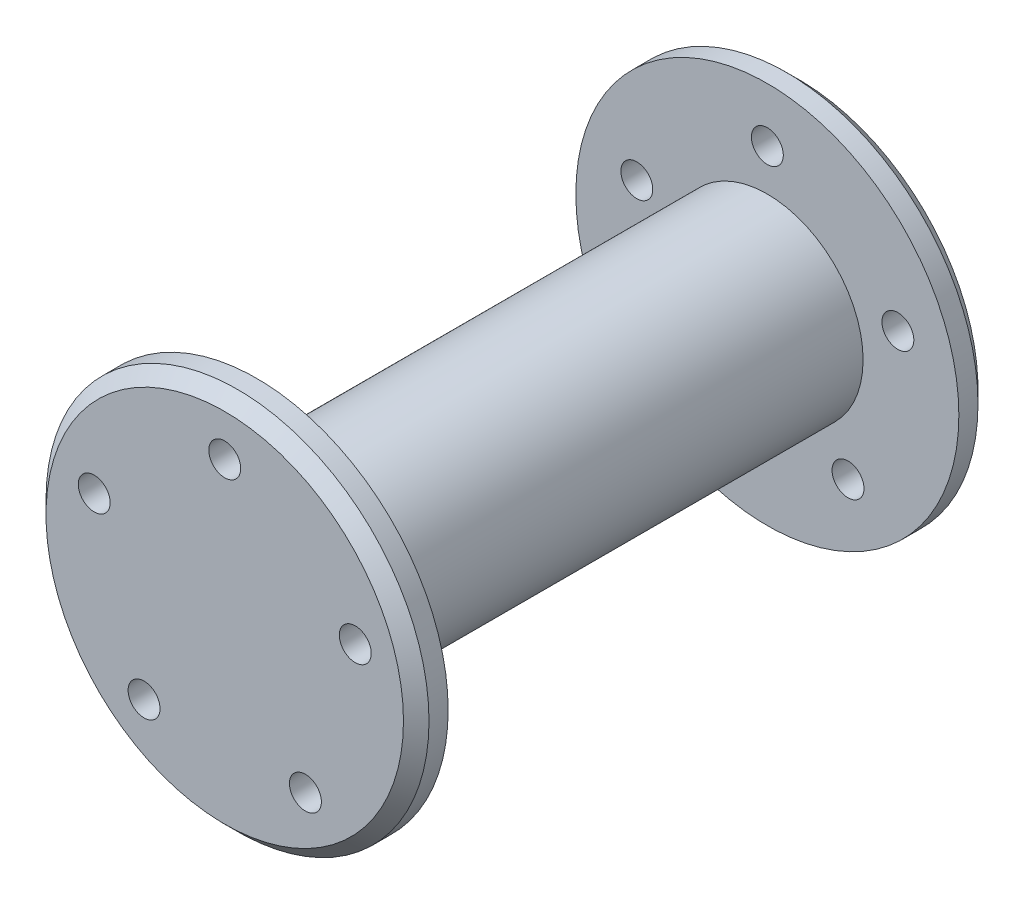
ISO-10303-21;
HEADER;
FILE_DESCRIPTION(('STEP AP214'),'2;1');
FILE_NAME('part.step','',(''),(''),'','','');
FILE_SCHEMA(('AUTOMOTIVE_DESIGN { 1 0 10303 214 1 1 1 1 }'));
ENDSEC;
DATA;
#1=APPLICATION_CONTEXT('core data for automotive mechanical design processes');
#2=APPLICATION_PROTOCOL_DEFINITION('international standard','automotive_design',2000,#1);
#3=PRODUCT_CONTEXT('',#1,'mechanical');
#4=PRODUCT('Part','Part','',(#3));
#5=PRODUCT_RELATED_PRODUCT_CATEGORY('part','',(#4));
#6=PRODUCT_DEFINITION_FORMATION('','',#4);
#7=PRODUCT_DEFINITION_CONTEXT('part definition',#1,'design');
#8=PRODUCT_DEFINITION('design','',#6,#7);
#9=PRODUCT_DEFINITION_SHAPE('','',#8);
#10=(LENGTH_UNIT() NAMED_UNIT(*) SI_UNIT(.MILLI.,.METRE.));
#11=(NAMED_UNIT(*) PLANE_ANGLE_UNIT() SI_UNIT($,.RADIAN.));
#12=(NAMED_UNIT(*) SI_UNIT($,.STERADIAN.) SOLID_ANGLE_UNIT());
#13=UNCERTAINTY_MEASURE_WITH_UNIT(LENGTH_MEASURE(1.E-05),#10,'distance_accuracy_value','');
#14=(GEOMETRIC_REPRESENTATION_CONTEXT(3) GLOBAL_UNCERTAINTY_ASSIGNED_CONTEXT((#13)) GLOBAL_UNIT_ASSIGNED_CONTEXT((#10,
#11,#12)) REPRESENTATION_CONTEXT('',''));
#15=CARTESIAN_POINT('',(0.,0.,0.));
#16=DIRECTION('',(0.,0.,1.));
#17=DIRECTION('',(1.,0.,0.));
#18=AXIS2_PLACEMENT_3D('',#15,#16,#17);
#19=CARTESIAN_POINT('',(0.,0.,80.));
#20=DIRECTION('',(0.,0.,-1.));
#21=DIRECTION('',(-1.,0.,0.));
#22=AXIS2_PLACEMENT_3D('',#19,#20,#21);
#23=CYLINDRICAL_SURFACE('',#22,15.);
#24=CARTESIAN_POINT('',(0.,0.,80.));
#25=DIRECTION('',(0.,0.,1.));
#26=DIRECTION('',(1.,0.,0.));
#27=AXIS2_PLACEMENT_3D('',#24,#25,#26);
#28=CIRCLE('',#27,15.);
#29=CARTESIAN_POINT('',(15.,0.,80.));
#30=VERTEX_POINT('',#29);
#31=EDGE_CURVE('E115',#30,#30,#28,.T.);
#32=ORIENTED_EDGE('',*,*,#31,.F.);
#33=EDGE_LOOP('',(#32));
#34=FACE_BOUND('',#33,.T.);
#35=CARTESIAN_POINT('',(0.,0.,0.));
#36=DIRECTION('',(0.,0.,1.));
#37=DIRECTION('',(1.,0.,0.));
#38=AXIS2_PLACEMENT_3D('',#35,#36,#37);
#39=CIRCLE('',#38,15.);
#40=CARTESIAN_POINT('',(15.,0.,0.));
#41=VERTEX_POINT('',#40);
#42=EDGE_CURVE('E114',#41,#41,#39,.T.);
#43=ORIENTED_EDGE('',*,*,#42,.T.);
#44=EDGE_LOOP('',(#43));
#45=FACE_BOUND('',#44,.T.);
#46=ADVANCED_FACE('F37',(#34,#45),#23,.T.);
#47=CARTESIAN_POINT('',(0.,0.,-5.));
#48=DIRECTION('',(0.,0.,1.));
#49=DIRECTION('',(1.,0.,0.));
#50=AXIS2_PLACEMENT_3D('',#47,#48,#49);
#51=CYLINDRICAL_SURFACE('',#50,30.);
#52=CARTESIAN_POINT('',(0.,0.,-3.00000000000002));
#53=DIRECTION('',(0.,0.,-1.));
#54=DIRECTION('',(-1.,0.,0.));
#55=AXIS2_PLACEMENT_3D('',#52,#53,#54);
#56=CIRCLE('',#55,30.);
#57=CARTESIAN_POINT('',(-30.,0.,-3.00000000000002));
#58=VERTEX_POINT('',#57);
#59=EDGE_CURVE('E52',#58,#58,#56,.F.);
#60=ORIENTED_EDGE('',*,*,#59,.T.);
#61=EDGE_LOOP('',(#60));
#62=FACE_BOUND('',#61,.T.);
#63=CARTESIAN_POINT('',(0.,0.,0.));
#64=DIRECTION('',(0.,0.,-1.));
#65=DIRECTION('',(-1.,0.,0.));
#66=AXIS2_PLACEMENT_3D('',#63,#64,#65);
#67=CIRCLE('',#66,30.);
#68=CARTESIAN_POINT('',(-30.,0.,0.));
#69=VERTEX_POINT('',#68);
#70=EDGE_CURVE('E110',#69,#69,#67,.T.);
#71=ORIENTED_EDGE('',*,*,#70,.T.);
#72=EDGE_LOOP('',(#71));
#73=FACE_BOUND('',#72,.T.);
#74=ADVANCED_FACE('F166',(#62,#73),#51,.T.);
#75=CARTESIAN_POINT('',(0.,0.,-5.));
#76=DIRECTION('',(0.,0.,-1.));
#77=DIRECTION('',(-1.,0.,0.));
#78=AXIS2_PLACEMENT_3D('',#75,#76,#77);
#79=PLANE('',#78);
#80=CARTESIAN_POINT('',(-20.4477151003458,6.64386537906131,-5.));
#81=DIRECTION('',(0.,0.,-1.));
#82=DIRECTION('',(-0.309016994374945,-0.951056516295155,0.));
#83=AXIS2_PLACEMENT_3D('',#80,#81,#82);
#84=CIRCLE('',#83,2.5);
#85=CARTESIAN_POINT('',(-21.2202575862832,4.26622408832343,-5.));
#86=VERTEX_POINT('',#85);
#87=EDGE_CURVE('E92',#86,#86,#84,.T.);
#88=ORIENTED_EDGE('',*,*,#87,.F.);
#89=EDGE_LOOP('',(#88));
#90=FACE_BOUND('',#89,.T.);
#91=CARTESIAN_POINT('',(-12.6373829242881,-17.3938653790614,-5.));
#92=DIRECTION('',(0.,0.,-1.));
#93=DIRECTION('',(0.809016994374951,-0.587785252292469,0.));
#94=AXIS2_PLACEMENT_3D('',#91,#92,#93);
#95=CIRCLE('',#94,2.5);
#96=CARTESIAN_POINT('',(-10.6148404383507,-18.8633285097926,-5.));
#97=VERTEX_POINT('',#96);
#98=EDGE_CURVE('E97',#97,#97,#95,.T.);
#99=ORIENTED_EDGE('',*,*,#98,.F.);
#100=EDGE_LOOP('',(#99));
#101=FACE_BOUND('',#100,.T.);
#102=CARTESIAN_POINT('',(12.6373829242883,-17.3938653790613,-5.));
#103=DIRECTION('',(0.,0.,-1.));
#104=DIRECTION('',(0.809016994374942,0.58778525229248,0.));
#105=AXIS2_PLACEMENT_3D('',#102,#103,#104);
#106=CIRCLE('',#105,2.5);
#107=CARTESIAN_POINT('',(14.6599254102257,-15.9244022483301,-5.));
#108=VERTEX_POINT('',#107);
#109=EDGE_CURVE('E86',#108,#108,#106,.T.);
#110=ORIENTED_EDGE('',*,*,#109,.F.);
#111=EDGE_LOOP('',(#110));
#112=FACE_BOUND('',#111,.T.);
#113=CARTESIAN_POINT('',(20.4477151003457,6.6438653790616,-5.));
#114=DIRECTION('',(0.,0.,-1.));
#115=DIRECTION('',(-0.309016994374958,0.95105651629515,0.));
#116=AXIS2_PLACEMENT_3D('',#113,#114,#115);
#117=CIRCLE('',#116,2.5);
#118=CARTESIAN_POINT('',(19.6751726144083,9.02150666979948,-5.));
#119=VERTEX_POINT('',#118);
#120=EDGE_CURVE('E80',#119,#119,#117,.T.);
#121=ORIENTED_EDGE('',*,*,#120,.F.);
#122=EDGE_LOOP('',(#121));
#123=FACE_BOUND('',#122,.T.);
#124=CARTESIAN_POINT('',(0.,21.5,-5.));
#125=DIRECTION('',(0.,0.,-1.));
#126=DIRECTION('',(-1.,0.,0.));
#127=AXIS2_PLACEMENT_3D('',#124,#125,#126);
#128=CIRCLE('',#127,2.5);
#129=CARTESIAN_POINT('',(-2.5,21.5,-5.));
#130=VERTEX_POINT('',#129);
#131=EDGE_CURVE('E104',#130,#130,#128,.T.);
#132=ORIENTED_EDGE('',*,*,#131,.F.);
#133=EDGE_LOOP('',(#132));
#134=FACE_BOUND('',#133,.T.);
#135=CARTESIAN_POINT('',(0.,0.,-5.));
#136=DIRECTION('',(0.,0.,-1.));
#137=DIRECTION('',(-1.,0.,0.));
#138=AXIS2_PLACEMENT_3D('',#135,#136,#137);
#139=CIRCLE('',#138,28.);
#140=CARTESIAN_POINT('',(-28.,0.,-5.));
#141=VERTEX_POINT('',#140);
#142=EDGE_CURVE('E119',#141,#141,#139,.T.);
#143=ORIENTED_EDGE('',*,*,#142,.T.);
#144=EDGE_LOOP('',(#143));
#145=FACE_BOUND('',#144,.T.);
#146=ADVANCED_FACE('F172',(#90,#101,#112,#123,#134,#145),#79,.T.);
#147=CARTESIAN_POINT('',(0.,0.,0.));
#148=DIRECTION('',(0.,0.,-1.));
#149=DIRECTION('',(-1.,0.,0.));
#150=AXIS2_PLACEMENT_3D('',#147,#148,#149);
#151=PLANE('',#150);
#152=CARTESIAN_POINT('',(-20.4477151003458,6.64386537906131,0.));
#153=DIRECTION('',(0.,0.,-1.));
#154=DIRECTION('',(-1.,0.,0.));
#155=AXIS2_PLACEMENT_3D('',#152,#153,#154);
#156=CIRCLE('',#155,2.5);
#157=CARTESIAN_POINT('',(-22.9477151003458,6.64386537906131,0.));
#158=VERTEX_POINT('',#157);
#159=EDGE_CURVE('E109',#158,#158,#156,.T.);
#160=ORIENTED_EDGE('',*,*,#159,.T.);
#161=EDGE_LOOP('',(#160));
#162=FACE_BOUND('',#161,.T.);
#163=CARTESIAN_POINT('',(-12.6373829242881,-17.3938653790614,0.));
#164=DIRECTION('',(0.,0.,-1.));
#165=DIRECTION('',(-1.,0.,0.));
#166=AXIS2_PLACEMENT_3D('',#163,#164,#165);
#167=CIRCLE('',#166,2.5);
#168=CARTESIAN_POINT('',(-15.1373829242881,-17.3938653790614,0.));
#169=VERTEX_POINT('',#168);
#170=EDGE_CURVE('E139',#169,#169,#167,.T.);
#171=ORIENTED_EDGE('',*,*,#170,.T.);
#172=EDGE_LOOP('',(#171));
#173=FACE_BOUND('',#172,.T.);
#174=CARTESIAN_POINT('',(12.6373829242883,-17.3938653790613,0.));
#175=DIRECTION('',(0.,0.,-1.));
#176=DIRECTION('',(-1.,0.,0.));
#177=AXIS2_PLACEMENT_3D('',#174,#175,#176);
#178=CIRCLE('',#177,2.5);
#179=CARTESIAN_POINT('',(10.1373829242883,-17.3938653790613,0.));
#180=VERTEX_POINT('',#179);
#181=EDGE_CURVE('E135',#180,#180,#178,.T.);
#182=ORIENTED_EDGE('',*,*,#181,.T.);
#183=EDGE_LOOP('',(#182));
#184=FACE_BOUND('',#183,.T.);
#185=CARTESIAN_POINT('',(20.4477151003457,6.6438653790616,0.));
#186=DIRECTION('',(0.,0.,-1.));
#187=DIRECTION('',(-1.,0.,0.));
#188=AXIS2_PLACEMENT_3D('',#185,#186,#187);
#189=CIRCLE('',#188,2.5);
#190=CARTESIAN_POINT('',(17.9477151003457,6.6438653790616,0.));
#191=VERTEX_POINT('',#190);
#192=EDGE_CURVE('E96',#191,#191,#189,.T.);
#193=ORIENTED_EDGE('',*,*,#192,.T.);
#194=EDGE_LOOP('',(#193));
#195=FACE_BOUND('',#194,.T.);
#196=CARTESIAN_POINT('',(0.,21.5,0.));
#197=DIRECTION('',(0.,0.,-1.));
#198=DIRECTION('',(-1.,0.,0.));
#199=AXIS2_PLACEMENT_3D('',#196,#197,#198);
#200=CIRCLE('',#199,2.5);
#201=CARTESIAN_POINT('',(-2.5,21.5,0.));
#202=VERTEX_POINT('',#201);
#203=EDGE_CURVE('E108',#202,#202,#200,.T.);
#204=ORIENTED_EDGE('',*,*,#203,.T.);
#205=EDGE_LOOP('',(#204));
#206=FACE_BOUND('',#205,.T.);
#207=ORIENTED_EDGE('',*,*,#42,.F.);
#208=EDGE_LOOP('',(#207));
#209=FACE_BOUND('',#208,.T.);
#210=ORIENTED_EDGE('',*,*,#70,.F.);
#211=EDGE_LOOP('',(#210));
#212=FACE_BOUND('',#211,.T.);
#213=ADVANCED_FACE('F146',(#162,#173,#184,#195,#206,#209,#212),#151,.F.);
#214=CARTESIAN_POINT('',(0.,0.,-5.));
#215=DIRECTION('',(0.,0.,1.));
#216=DIRECTION('',(1.,0.,0.));
#217=AXIS2_PLACEMENT_3D('',#214,#215,#216);
#218=CONICAL_SURFACE('',#217,28.,0.785398163397451);
#219=ORIENTED_EDGE('',*,*,#59,.F.);
#220=EDGE_LOOP('',(#219));
#221=FACE_BOUND('',#220,.T.);
#222=ORIENTED_EDGE('',*,*,#142,.F.);
#223=EDGE_LOOP('',(#222));
#224=FACE_BOUND('',#223,.T.);
#225=ADVANCED_FACE('F178',(#221,#224),#218,.T.);
#226=CARTESIAN_POINT('',(0.,21.5,80.));
#227=DIRECTION('',(0.,0.,-1.));
#228=DIRECTION('',(-1.,0.,0.));
#229=AXIS2_PLACEMENT_3D('',#226,#227,#228);
#230=CYLINDRICAL_SURFACE('',#229,2.5);
#231=ORIENTED_EDGE('',*,*,#131,.T.);
#232=EDGE_LOOP('',(#231));
#233=FACE_BOUND('',#232,.T.);
#234=ORIENTED_EDGE('',*,*,#203,.F.);
#235=EDGE_LOOP('',(#234));
#236=FACE_BOUND('',#235,.T.);
#237=ADVANCED_FACE('F180',(#233,#236),#230,.F.);
#238=CARTESIAN_POINT('',(20.4477151003457,6.6438653790616,80.));
#239=DIRECTION('',(0.,0.,-1.));
#240=DIRECTION('',(-1.,0.,0.));
#241=AXIS2_PLACEMENT_3D('',#238,#239,#240);
#242=CYLINDRICAL_SURFACE('',#241,2.5);
#243=ORIENTED_EDGE('',*,*,#120,.T.);
#244=EDGE_LOOP('',(#243));
#245=FACE_BOUND('',#244,.T.);
#246=ORIENTED_EDGE('',*,*,#192,.F.);
#247=EDGE_LOOP('',(#246));
#248=FACE_BOUND('',#247,.T.);
#249=ADVANCED_FACE('F186',(#245,#248),#242,.F.);
#250=CARTESIAN_POINT('',(12.6373829242883,-17.3938653790613,80.));
#251=DIRECTION('',(0.,0.,-1.));
#252=DIRECTION('',(-1.,0.,0.));
#253=AXIS2_PLACEMENT_3D('',#250,#251,#252);
#254=CYLINDRICAL_SURFACE('',#253,2.5);
#255=ORIENTED_EDGE('',*,*,#109,.T.);
#256=EDGE_LOOP('',(#255));
#257=FACE_BOUND('',#256,.T.);
#258=ORIENTED_EDGE('',*,*,#181,.F.);
#259=EDGE_LOOP('',(#258));
#260=FACE_BOUND('',#259,.T.);
#261=ADVANCED_FACE('F162',(#257,#260),#254,.F.);
#262=CARTESIAN_POINT('',(-12.6373829242881,-17.3938653790614,80.));
#263=DIRECTION('',(0.,0.,-1.));
#264=DIRECTION('',(-1.,0.,0.));
#265=AXIS2_PLACEMENT_3D('',#262,#263,#264);
#266=CYLINDRICAL_SURFACE('',#265,2.5);
#267=ORIENTED_EDGE('',*,*,#98,.T.);
#268=EDGE_LOOP('',(#267));
#269=FACE_BOUND('',#268,.T.);
#270=ORIENTED_EDGE('',*,*,#170,.F.);
#271=EDGE_LOOP('',(#270));
#272=FACE_BOUND('',#271,.T.);
#273=ADVANCED_FACE('F152',(#269,#272),#266,.F.);
#274=CARTESIAN_POINT('',(-20.4477151003458,6.64386537906131,80.));
#275=DIRECTION('',(0.,0.,-1.));
#276=DIRECTION('',(-1.,0.,0.));
#277=AXIS2_PLACEMENT_3D('',#274,#275,#276);
#278=CYLINDRICAL_SURFACE('',#277,2.5);
#279=ORIENTED_EDGE('',*,*,#87,.T.);
#280=EDGE_LOOP('',(#279));
#281=FACE_BOUND('',#280,.T.);
#282=ORIENTED_EDGE('',*,*,#159,.F.);
#283=EDGE_LOOP('',(#282));
#284=FACE_BOUND('',#283,.T.);
#285=ADVANCED_FACE('F149',(#281,#284),#278,.F.);
#286=CARTESIAN_POINT('',(0.,0.,85.));
#287=DIRECTION('',(0.,0.,-1.));
#288=DIRECTION('',(-1.,0.,0.));
#289=AXIS2_PLACEMENT_3D('',#286,#287,#288);
#290=CYLINDRICAL_SURFACE('',#289,30.);
#291=CARTESIAN_POINT('',(0.,0.,83.));
#292=DIRECTION('',(0.,0.,1.));
#293=DIRECTION('',(1.,0.,0.));
#294=AXIS2_PLACEMENT_3D('',#291,#292,#293);
#295=CIRCLE('',#294,30.);
#296=CARTESIAN_POINT('',(30.,0.,83.));
#297=VERTEX_POINT('',#296);
#298=EDGE_CURVE('E46',#297,#297,#295,.F.);
#299=ORIENTED_EDGE('',*,*,#298,.T.);
#300=EDGE_LOOP('',(#299));
#301=FACE_BOUND('',#300,.T.);
#302=CARTESIAN_POINT('',(0.,0.,80.));
#303=DIRECTION('',(0.,0.,-1.));
#304=DIRECTION('',(-1.,0.,0.));
#305=AXIS2_PLACEMENT_3D('',#302,#303,#304);
#306=CIRCLE('',#305,30.);
#307=CARTESIAN_POINT('',(-30.,0.,80.));
#308=VERTEX_POINT('',#307);
#309=EDGE_CURVE('E75',#308,#308,#306,.T.);
#310=ORIENTED_EDGE('',*,*,#309,.F.);
#311=EDGE_LOOP('',(#310));
#312=FACE_BOUND('',#311,.T.);
#313=ADVANCED_FACE('F151',(#301,#312),#290,.T.);
#314=CARTESIAN_POINT('',(0.,0.,85.));
#315=DIRECTION('',(0.,0.,1.));
#316=DIRECTION('',(-1.,0.,0.));
#317=AXIS2_PLACEMENT_3D('',#314,#315,#316);
#318=PLANE('',#317);
#319=CARTESIAN_POINT('',(0.,21.5,85.));
#320=DIRECTION('',(0.,0.,-1.));
#321=DIRECTION('',(-1.,0.,0.));
#322=AXIS2_PLACEMENT_3D('',#319,#320,#321);
#323=CIRCLE('',#322,2.5);
#324=CARTESIAN_POINT('',(2.5,21.5,85.));
#325=VERTEX_POINT('',#324);
#326=EDGE_CURVE('E61',#325,#325,#323,.T.);
#327=ORIENTED_EDGE('',*,*,#326,.T.);
#328=EDGE_LOOP('',(#327));
#329=FACE_BOUND('',#328,.T.);
#330=CARTESIAN_POINT('',(-20.4477151003458,6.64386537906131,85.));
#331=DIRECTION('',(0.,0.,-1.));
#332=DIRECTION('',(-0.309016994374945,-0.951056516295155,0.));
#333=AXIS2_PLACEMENT_3D('',#330,#331,#332);
#334=CIRCLE('',#333,2.5);
#335=CARTESIAN_POINT('',(-17.9477151003458,6.64386537906131,85.));
#336=VERTEX_POINT('',#335);
#337=EDGE_CURVE('E328',#336,#336,#334,.T.);
#338=ORIENTED_EDGE('',*,*,#337,.T.);
#339=EDGE_LOOP('',(#338));
#340=FACE_BOUND('',#339,.T.);
#341=CARTESIAN_POINT('',(-12.6373829242881,-17.3938653790614,85.));
#342=DIRECTION('',(0.,0.,-1.));
#343=DIRECTION('',(0.809016994374951,-0.587785252292469,0.));
#344=AXIS2_PLACEMENT_3D('',#341,#342,#343);
#345=CIRCLE('',#344,2.5);
#346=CARTESIAN_POINT('',(-10.1373829242881,-17.3938653790614,85.));
#347=VERTEX_POINT('',#346);
#348=EDGE_CURVE('E332',#347,#347,#345,.T.);
#349=ORIENTED_EDGE('',*,*,#348,.T.);
#350=EDGE_LOOP('',(#349));
#351=FACE_BOUND('',#350,.T.);
#352=CARTESIAN_POINT('',(12.6373829242883,-17.3938653790613,85.));
#353=DIRECTION('',(0.,0.,-1.));
#354=DIRECTION('',(0.809016994374942,0.58778525229248,0.));
#355=AXIS2_PLACEMENT_3D('',#352,#353,#354);
#356=CIRCLE('',#355,2.5);
#357=CARTESIAN_POINT('',(15.1373829242883,-17.3938653790613,85.));
#358=VERTEX_POINT('',#357);
#359=EDGE_CURVE('E337',#358,#358,#356,.T.);
#360=ORIENTED_EDGE('',*,*,#359,.T.);
#361=EDGE_LOOP('',(#360));
#362=FACE_BOUND('',#361,.T.);
#363=CARTESIAN_POINT('',(20.4477151003457,6.6438653790616,85.));
#364=DIRECTION('',(0.,0.,-1.));
#365=DIRECTION('',(-0.309016994374958,0.95105651629515,0.));
#366=AXIS2_PLACEMENT_3D('',#363,#364,#365);
#367=CIRCLE('',#366,2.5);
#368=CARTESIAN_POINT('',(22.9477151003457,6.6438653790616,85.));
#369=VERTEX_POINT('',#368);
#370=EDGE_CURVE('E90',#369,#369,#367,.T.);
#371=ORIENTED_EDGE('',*,*,#370,.T.);
#372=EDGE_LOOP('',(#371));
#373=FACE_BOUND('',#372,.T.);
#374=CARTESIAN_POINT('',(0.,0.,85.));
#375=DIRECTION('',(0.,0.,1.));
#376=DIRECTION('',(1.,0.,0.));
#377=AXIS2_PLACEMENT_3D('',#374,#375,#376);
#378=CIRCLE('',#377,28.);
#379=CARTESIAN_POINT('',(28.,0.,85.));
#380=VERTEX_POINT('',#379);
#381=EDGE_CURVE('E10',#380,#380,#378,.T.);
#382=ORIENTED_EDGE('',*,*,#381,.T.);
#383=EDGE_LOOP('',(#382));
#384=FACE_BOUND('',#383,.T.);
#385=ADVANCED_FACE('F159',(#329,#340,#351,#362,#373,#384),#318,.T.);
#386=CARTESIAN_POINT('',(0.,0.,80.));
#387=DIRECTION('',(0.,0.,1.));
#388=DIRECTION('',(-1.,0.,0.));
#389=AXIS2_PLACEMENT_3D('',#386,#387,#388);
#390=PLANE('',#389);
#391=CARTESIAN_POINT('',(0.,21.5,80.));
#392=DIRECTION('',(0.,0.,1.));
#393=DIRECTION('',(1.,0.,0.));
#394=AXIS2_PLACEMENT_3D('',#391,#392,#393);
#395=CIRCLE('',#394,2.5);
#396=CARTESIAN_POINT('',(2.5,21.5,80.));
#397=VERTEX_POINT('',#396);
#398=EDGE_CURVE('E41',#397,#397,#395,.F.);
#399=ORIENTED_EDGE('',*,*,#398,.F.);
#400=EDGE_LOOP('',(#399));
#401=FACE_BOUND('',#400,.T.);
#402=CARTESIAN_POINT('',(-20.4477151003458,6.64386537906131,80.));
#403=DIRECTION('',(0.,0.,1.));
#404=DIRECTION('',(1.,0.,0.));
#405=AXIS2_PLACEMENT_3D('',#402,#403,#404);
#406=CIRCLE('',#405,2.5);
#407=CARTESIAN_POINT('',(-17.9477151003458,6.64386537906131,80.));
#408=VERTEX_POINT('',#407);
#409=EDGE_CURVE('E68',#408,#408,#406,.F.);
#410=ORIENTED_EDGE('',*,*,#409,.F.);
#411=EDGE_LOOP('',(#410));
#412=FACE_BOUND('',#411,.T.);
#413=CARTESIAN_POINT('',(-12.6373829242881,-17.3938653790614,80.));
#414=DIRECTION('',(0.,0.,1.));
#415=DIRECTION('',(1.,0.,0.));
#416=AXIS2_PLACEMENT_3D('',#413,#414,#415);
#417=CIRCLE('',#416,2.5);
#418=CARTESIAN_POINT('',(-10.1373829242881,-17.3938653790614,80.));
#419=VERTEX_POINT('',#418);
#420=EDGE_CURVE('E65',#419,#419,#417,.F.);
#421=ORIENTED_EDGE('',*,*,#420,.F.);
#422=EDGE_LOOP('',(#421));
#423=FACE_BOUND('',#422,.T.);
#424=CARTESIAN_POINT('',(12.6373829242883,-17.3938653790613,80.));
#425=DIRECTION('',(0.,0.,1.));
#426=DIRECTION('',(1.,0.,0.));
#427=AXIS2_PLACEMENT_3D('',#424,#425,#426);
#428=CIRCLE('',#427,2.5);
#429=CARTESIAN_POINT('',(15.1373829242883,-17.3938653790613,80.));
#430=VERTEX_POINT('',#429);
#431=EDGE_CURVE('E60',#430,#430,#428,.F.);
#432=ORIENTED_EDGE('',*,*,#431,.F.);
#433=EDGE_LOOP('',(#432));
#434=FACE_BOUND('',#433,.T.);
#435=CARTESIAN_POINT('',(20.4477151003457,6.6438653790616,80.));
#436=DIRECTION('',(0.,0.,1.));
#437=DIRECTION('',(1.,0.,0.));
#438=AXIS2_PLACEMENT_3D('',#435,#436,#437);
#439=CIRCLE('',#438,2.5);
#440=CARTESIAN_POINT('',(22.9477151003457,6.6438653790616,80.));
#441=VERTEX_POINT('',#440);
#442=EDGE_CURVE('E56',#441,#441,#439,.F.);
#443=ORIENTED_EDGE('',*,*,#442,.F.);
#444=EDGE_LOOP('',(#443));
#445=FACE_BOUND('',#444,.T.);
#446=ORIENTED_EDGE('',*,*,#31,.T.);
#447=EDGE_LOOP('',(#446));
#448=FACE_BOUND('',#447,.T.);
#449=ORIENTED_EDGE('',*,*,#309,.T.);
#450=EDGE_LOOP('',(#449));
#451=FACE_BOUND('',#450,.T.);
#452=ADVANCED_FACE('F253',(#401,#412,#423,#434,#445,#448,#451),#390,.F.);
#453=CARTESIAN_POINT('',(0.,0.,83.));
#454=DIRECTION('',(0.,0.,-1.));
#455=DIRECTION('',(-1.,0.,0.));
#456=AXIS2_PLACEMENT_3D('',#453,#454,#455);
#457=CONICAL_SURFACE('',#456,30.,0.785398163397445);
#458=ORIENTED_EDGE('',*,*,#381,.F.);
#459=EDGE_LOOP('',(#458));
#460=FACE_BOUND('',#459,.T.);
#461=ORIENTED_EDGE('',*,*,#298,.F.);
#462=EDGE_LOOP('',(#461));
#463=FACE_BOUND('',#462,.T.);
#464=ADVANCED_FACE('F39',(#460,#463),#457,.T.);
#465=CARTESIAN_POINT('',(20.4477151003457,6.6438653790616,-5.));
#466=DIRECTION('',(0.,0.,1.));
#467=DIRECTION('',(1.,0.,0.));
#468=AXIS2_PLACEMENT_3D('',#465,#466,#467);
#469=CYLINDRICAL_SURFACE('',#468,2.5);
#470=CARTESIAN_POINT('',(22.9477151003457,6.6438653790616,85.));
#471=CARTESIAN_POINT('',(22.9477151003457,6.6438653790616,84.9479166666667));
#472=CARTESIAN_POINT('',(22.9477151003457,6.6438653790616,84.8958333333333));
#473=CARTESIAN_POINT('',(22.9477151003457,6.6438653790616,84.7916666666667));
#474=CARTESIAN_POINT('',(22.9477151003457,6.6438653790616,84.7395833333333));
#475=CARTESIAN_POINT('',(22.9477151003457,6.6438653790616,84.6354166666667));
#476=CARTESIAN_POINT('',(22.9477151003457,6.6438653790616,84.5833333333333));
#477=CARTESIAN_POINT('',(22.9477151003457,6.6438653790616,84.4791666666667));
#478=CARTESIAN_POINT('',(22.9477151003457,6.6438653790616,84.4270833333333));
#479=CARTESIAN_POINT('',(22.9477151003457,6.6438653790616,84.3229166666667));
#480=CARTESIAN_POINT('',(22.9477151003457,6.6438653790616,84.2708333333333));
#481=CARTESIAN_POINT('',(22.9477151003457,6.6438653790616,84.1666666666667));
#482=CARTESIAN_POINT('',(22.9477151003457,6.6438653790616,84.1145833333333));
#483=CARTESIAN_POINT('',(22.9477151003457,6.6438653790616,84.0104166666667));
#484=CARTESIAN_POINT('',(22.9477151003457,6.6438653790616,83.9583333333333));
#485=CARTESIAN_POINT('',(22.9477151003457,6.6438653790616,83.8541666666667));
#486=CARTESIAN_POINT('',(22.9477151003457,6.6438653790616,83.8020833333333));
#487=CARTESIAN_POINT('',(22.9477151003457,6.6438653790616,83.6979166666667));
#488=CARTESIAN_POINT('',(22.9477151003457,6.6438653790616,83.6458333333333));
#489=CARTESIAN_POINT('',(22.9477151003457,6.6438653790616,83.5416666666667));
#490=CARTESIAN_POINT('',(22.9477151003457,6.6438653790616,83.4895833333333));
#491=CARTESIAN_POINT('',(22.9477151003457,6.6438653790616,83.3854166666667));
#492=CARTESIAN_POINT('',(22.9477151003457,6.6438653790616,83.3333333333333));
#493=CARTESIAN_POINT('',(22.9477151003457,6.6438653790616,83.2291666666667));
#494=CARTESIAN_POINT('',(22.9477151003457,6.6438653790616,83.1770833333333));
#495=CARTESIAN_POINT('',(22.9477151003457,6.6438653790616,83.0729166666667));
#496=CARTESIAN_POINT('',(22.9477151003457,6.6438653790616,83.0208333333333));
#497=CARTESIAN_POINT('',(22.9477151003457,6.6438653790616,82.9166666666667));
#498=CARTESIAN_POINT('',(22.9477151003457,6.6438653790616,82.8645833333333));
#499=CARTESIAN_POINT('',(22.9477151003457,6.6438653790616,82.7604166666667));
#500=CARTESIAN_POINT('',(22.9477151003457,6.6438653790616,82.7083333333333));
#501=CARTESIAN_POINT('',(22.9477151003457,6.6438653790616,82.6041666666667));
#502=CARTESIAN_POINT('',(22.9477151003457,6.6438653790616,82.5520833333333));
#503=CARTESIAN_POINT('',(22.9477151003457,6.6438653790616,82.4479166666667));
#504=CARTESIAN_POINT('',(22.9477151003457,6.6438653790616,82.3958333333333));
#505=CARTESIAN_POINT('',(22.9477151003457,6.6438653790616,82.2916666666667));
#506=CARTESIAN_POINT('',(22.9477151003457,6.6438653790616,82.2395833333333));
#507=CARTESIAN_POINT('',(22.9477151003457,6.6438653790616,82.1354166666667));
#508=CARTESIAN_POINT('',(22.9477151003457,6.6438653790616,82.0833333333333));
#509=CARTESIAN_POINT('',(22.9477151003457,6.6438653790616,81.9791666666667));
#510=CARTESIAN_POINT('',(22.9477151003457,6.6438653790616,81.9270833333333));
#511=CARTESIAN_POINT('',(22.9477151003457,6.6438653790616,81.8229166666667));
#512=CARTESIAN_POINT('',(22.9477151003457,6.6438653790616,81.7708333333333));
#513=CARTESIAN_POINT('',(22.9477151003457,6.6438653790616,81.6666666666667));
#514=CARTESIAN_POINT('',(22.9477151003457,6.6438653790616,81.6145833333333));
#515=CARTESIAN_POINT('',(22.9477151003457,6.6438653790616,81.5104166666667));
#516=CARTESIAN_POINT('',(22.9477151003457,6.6438653790616,81.4583333333333));
#517=CARTESIAN_POINT('',(22.9477151003457,6.6438653790616,81.3541666666667));
#518=CARTESIAN_POINT('',(22.9477151003457,6.6438653790616,81.3020833333333));
#519=CARTESIAN_POINT('',(22.9477151003457,6.6438653790616,81.1979166666667));
#520=CARTESIAN_POINT('',(22.9477151003457,6.6438653790616,81.1458333333333));
#521=CARTESIAN_POINT('',(22.9477151003457,6.6438653790616,81.0416666666667));
#522=CARTESIAN_POINT('',(22.9477151003457,6.6438653790616,80.9895833333333));
#523=CARTESIAN_POINT('',(22.9477151003457,6.6438653790616,80.8854166666667));
#524=CARTESIAN_POINT('',(22.9477151003457,6.6438653790616,80.8333333333333));
#525=CARTESIAN_POINT('',(22.9477151003457,6.6438653790616,80.7291666666667));
#526=CARTESIAN_POINT('',(22.9477151003457,6.6438653790616,80.6770833333333));
#527=CARTESIAN_POINT('',(22.9477151003457,6.6438653790616,80.5729166666667));
#528=CARTESIAN_POINT('',(22.9477151003457,6.6438653790616,80.5208333333333));
#529=CARTESIAN_POINT('',(22.9477151003457,6.6438653790616,80.4166666666667));
#530=CARTESIAN_POINT('',(22.9477151003457,6.6438653790616,80.3645833333333));
#531=CARTESIAN_POINT('',(22.9477151003457,6.6438653790616,80.2604166666667));
#532=CARTESIAN_POINT('',(22.9477151003457,6.6438653790616,80.2083333333333));
#533=CARTESIAN_POINT('',(22.9477151003457,6.6438653790616,80.1041666666667));
#534=CARTESIAN_POINT('',(22.9477151003457,6.6438653790616,80.0520833333333));
#535=CARTESIAN_POINT('',(22.9477151003457,6.6438653790616,80.));
#536=B_SPLINE_CURVE_WITH_KNOTS('',3,(#470,#471,#472,#473,#474,#475,#476,#477,#478,#479,#480,
#481,#482,#483,#484,#485,#486,#487,#488,#489,#490,#491,#492,#493,#494,#495,#496,#497,#498,#499,
#500,#501,#502,#503,#504,#505,#506,#507,#508,#509,#510,#511,#512,#513,#514,#515,#516,#517,#518,
#519,#520,#521,#522,#523,#524,#525,#526,#527,#528,#529,#530,#531,#532,#533,#534,#535),
.UNSPECIFIED.,.F.,.F.,(4,2,2,2,2,2,2,2,2,2,2,2,2,2,2,2,2,2,2,2,2,2,2,2,2,2,2,2,2,2,2,2,4),(0.,
0.156249999999997,0.312499999999993,0.468750000000004,0.625000000000001,0.781249999999997,
0.937500000000008,1.09375,1.25,1.40625,1.56249999999999,1.71875,1.875,2.03125,2.18750000000001,
2.34375000000001,2.5,2.65625,2.8125,2.96875000000001,3.125,3.28125,3.43750000000001,
3.59375000000001,3.75,3.90625,4.0625,4.21875000000001,4.375,4.53125,4.68750000000001,
4.84375000000001,5.),.UNSPECIFIED.);
#537=EDGE_CURVE('BSEAM272',#369,#441,#536,.T.);
#538=ORIENTED_EDGE('',*,*,#370,.F.);
#539=ORIENTED_EDGE('',*,*,#442,.T.);
#540=ORIENTED_EDGE('',*,*,#537,.T.);
#541=ORIENTED_EDGE('',*,*,#537,.F.);
#542=EDGE_LOOP('',(#538,#540,#539,#541));
#543=FACE_BOUND('',#542,.T.);
#544=ADVANCED_FACE('F272',(#543),#469,.F.);
#545=CARTESIAN_POINT('',(12.6373829242883,-17.3938653790613,-5.));
#546=DIRECTION('',(0.,0.,1.));
#547=DIRECTION('',(1.,0.,0.));
#548=AXIS2_PLACEMENT_3D('',#545,#546,#547);
#549=CYLINDRICAL_SURFACE('',#548,2.5);
#550=CARTESIAN_POINT('',(15.1373829242883,-17.3938653790613,85.));
#551=CARTESIAN_POINT('',(15.1373829242883,-17.3938653790613,84.9479166666667));
#552=CARTESIAN_POINT('',(15.1373829242883,-17.3938653790613,84.8958333333333));
#553=CARTESIAN_POINT('',(15.1373829242883,-17.3938653790613,84.7916666666667));
#554=CARTESIAN_POINT('',(15.1373829242883,-17.3938653790613,84.7395833333333));
#555=CARTESIAN_POINT('',(15.1373829242883,-17.3938653790613,84.6354166666667));
#556=CARTESIAN_POINT('',(15.1373829242883,-17.3938653790613,84.5833333333333));
#557=CARTESIAN_POINT('',(15.1373829242883,-17.3938653790613,84.4791666666667));
#558=CARTESIAN_POINT('',(15.1373829242883,-17.3938653790613,84.4270833333333));
#559=CARTESIAN_POINT('',(15.1373829242883,-17.3938653790613,84.3229166666667));
#560=CARTESIAN_POINT('',(15.1373829242883,-17.3938653790613,84.2708333333333));
#561=CARTESIAN_POINT('',(15.1373829242883,-17.3938653790613,84.1666666666667));
#562=CARTESIAN_POINT('',(15.1373829242883,-17.3938653790613,84.1145833333333));
#563=CARTESIAN_POINT('',(15.1373829242883,-17.3938653790613,84.0104166666667));
#564=CARTESIAN_POINT('',(15.1373829242883,-17.3938653790613,83.9583333333333));
#565=CARTESIAN_POINT('',(15.1373829242883,-17.3938653790613,83.8541666666667));
#566=CARTESIAN_POINT('',(15.1373829242883,-17.3938653790613,83.8020833333333));
#567=CARTESIAN_POINT('',(15.1373829242883,-17.3938653790613,83.6979166666667));
#568=CARTESIAN_POINT('',(15.1373829242883,-17.3938653790613,83.6458333333333));
#569=CARTESIAN_POINT('',(15.1373829242883,-17.3938653790613,83.5416666666667));
#570=CARTESIAN_POINT('',(15.1373829242883,-17.3938653790613,83.4895833333333));
#571=CARTESIAN_POINT('',(15.1373829242883,-17.3938653790613,83.3854166666667));
#572=CARTESIAN_POINT('',(15.1373829242883,-17.3938653790613,83.3333333333333));
#573=CARTESIAN_POINT('',(15.1373829242883,-17.3938653790613,83.2291666666667));
#574=CARTESIAN_POINT('',(15.1373829242883,-17.3938653790613,83.1770833333333));
#575=CARTESIAN_POINT('',(15.1373829242883,-17.3938653790613,83.0729166666667));
#576=CARTESIAN_POINT('',(15.1373829242883,-17.3938653790613,83.0208333333333));
#577=CARTESIAN_POINT('',(15.1373829242883,-17.3938653790613,82.9166666666667));
#578=CARTESIAN_POINT('',(15.1373829242883,-17.3938653790613,82.8645833333333));
#579=CARTESIAN_POINT('',(15.1373829242883,-17.3938653790613,82.7604166666667));
#580=CARTESIAN_POINT('',(15.1373829242883,-17.3938653790613,82.7083333333333));
#581=CARTESIAN_POINT('',(15.1373829242883,-17.3938653790613,82.6041666666667));
#582=CARTESIAN_POINT('',(15.1373829242883,-17.3938653790613,82.5520833333333));
#583=CARTESIAN_POINT('',(15.1373829242883,-17.3938653790613,82.4479166666667));
#584=CARTESIAN_POINT('',(15.1373829242883,-17.3938653790613,82.3958333333333));
#585=CARTESIAN_POINT('',(15.1373829242883,-17.3938653790613,82.2916666666667));
#586=CARTESIAN_POINT('',(15.1373829242883,-17.3938653790613,82.2395833333333));
#587=CARTESIAN_POINT('',(15.1373829242883,-17.3938653790613,82.1354166666667));
#588=CARTESIAN_POINT('',(15.1373829242883,-17.3938653790613,82.0833333333333));
#589=CARTESIAN_POINT('',(15.1373829242883,-17.3938653790613,81.9791666666667));
#590=CARTESIAN_POINT('',(15.1373829242883,-17.3938653790613,81.9270833333333));
#591=CARTESIAN_POINT('',(15.1373829242883,-17.3938653790613,81.8229166666667));
#592=CARTESIAN_POINT('',(15.1373829242883,-17.3938653790613,81.7708333333333));
#593=CARTESIAN_POINT('',(15.1373829242883,-17.3938653790613,81.6666666666667));
#594=CARTESIAN_POINT('',(15.1373829242883,-17.3938653790613,81.6145833333333));
#595=CARTESIAN_POINT('',(15.1373829242883,-17.3938653790613,81.5104166666667));
#596=CARTESIAN_POINT('',(15.1373829242883,-17.3938653790613,81.4583333333333));
#597=CARTESIAN_POINT('',(15.1373829242883,-17.3938653790613,81.3541666666667));
#598=CARTESIAN_POINT('',(15.1373829242883,-17.3938653790613,81.3020833333333));
#599=CARTESIAN_POINT('',(15.1373829242883,-17.3938653790613,81.1979166666667));
#600=CARTESIAN_POINT('',(15.1373829242883,-17.3938653790613,81.1458333333333));
#601=CARTESIAN_POINT('',(15.1373829242883,-17.3938653790613,81.0416666666667));
#602=CARTESIAN_POINT('',(15.1373829242883,-17.3938653790613,80.9895833333333));
#603=CARTESIAN_POINT('',(15.1373829242883,-17.3938653790613,80.8854166666667));
#604=CARTESIAN_POINT('',(15.1373829242883,-17.3938653790613,80.8333333333333));
#605=CARTESIAN_POINT('',(15.1373829242883,-17.3938653790613,80.7291666666667));
#606=CARTESIAN_POINT('',(15.1373829242883,-17.3938653790613,80.6770833333333));
#607=CARTESIAN_POINT('',(15.1373829242883,-17.3938653790613,80.5729166666667));
#608=CARTESIAN_POINT('',(15.1373829242883,-17.3938653790613,80.5208333333333));
#609=CARTESIAN_POINT('',(15.1373829242883,-17.3938653790613,80.4166666666667));
#610=CARTESIAN_POINT('',(15.1373829242883,-17.3938653790613,80.3645833333333));
#611=CARTESIAN_POINT('',(15.1373829242883,-17.3938653790613,80.2604166666667));
#612=CARTESIAN_POINT('',(15.1373829242883,-17.3938653790613,80.2083333333333));
#613=CARTESIAN_POINT('',(15.1373829242883,-17.3938653790613,80.1041666666667));
#614=CARTESIAN_POINT('',(15.1373829242883,-17.3938653790613,80.0520833333333));
#615=CARTESIAN_POINT('',(15.1373829242883,-17.3938653790613,80.));
#616=B_SPLINE_CURVE_WITH_KNOTS('',3,(#550,#551,#552,#553,#554,#555,#556,#557,#558,#559,#560,
#561,#562,#563,#564,#565,#566,#567,#568,#569,#570,#571,#572,#573,#574,#575,#576,#577,#578,#579,
#580,#581,#582,#583,#584,#585,#586,#587,#588,#589,#590,#591,#592,#593,#594,#595,#596,#597,#598,
#599,#600,#601,#602,#603,#604,#605,#606,#607,#608,#609,#610,#611,#612,#613,#614,#615),
.UNSPECIFIED.,.F.,.F.,(4,2,2,2,2,2,2,2,2,2,2,2,2,2,2,2,2,2,2,2,2,2,2,2,2,2,2,2,2,2,2,2,4),(0.,
0.156249999999997,0.312499999999993,0.468750000000004,0.625000000000001,0.781249999999997,
0.937500000000008,1.09375,1.25,1.40625,1.56249999999999,1.71875,1.875,2.03125,2.18750000000001,
2.34375000000001,2.5,2.65625,2.8125,2.96875000000001,3.125,3.28125,3.43750000000001,
3.59375000000001,3.75,3.90625,4.0625,4.21875000000001,4.375,4.53125,4.68750000000001,
4.84375000000001,5.),.UNSPECIFIED.);
#617=EDGE_CURVE('BSEAM281',#358,#430,#616,.T.);
#618=ORIENTED_EDGE('',*,*,#359,.F.);
#619=ORIENTED_EDGE('',*,*,#431,.T.);
#620=ORIENTED_EDGE('',*,*,#617,.T.);
#621=ORIENTED_EDGE('',*,*,#617,.F.);
#622=EDGE_LOOP('',(#618,#620,#619,#621));
#623=FACE_BOUND('',#622,.T.);
#624=ADVANCED_FACE('F281',(#623),#549,.F.);
#625=CARTESIAN_POINT('',(-12.6373829242881,-17.3938653790614,-5.));
#626=DIRECTION('',(0.,0.,1.));
#627=DIRECTION('',(1.,0.,0.));
#628=AXIS2_PLACEMENT_3D('',#625,#626,#627);
#629=CYLINDRICAL_SURFACE('',#628,2.5);
#630=CARTESIAN_POINT('',(-10.1373829242881,-17.3938653790614,85.));
#631=CARTESIAN_POINT('',(-10.1373829242881,-17.3938653790614,84.9479166666667));
#632=CARTESIAN_POINT('',(-10.1373829242881,-17.3938653790614,84.8958333333333));
#633=CARTESIAN_POINT('',(-10.1373829242881,-17.3938653790614,84.7916666666667));
#634=CARTESIAN_POINT('',(-10.1373829242881,-17.3938653790614,84.7395833333333));
#635=CARTESIAN_POINT('',(-10.1373829242881,-17.3938653790614,84.6354166666667));
#636=CARTESIAN_POINT('',(-10.1373829242881,-17.3938653790614,84.5833333333333));
#637=CARTESIAN_POINT('',(-10.1373829242881,-17.3938653790614,84.4791666666667));
#638=CARTESIAN_POINT('',(-10.1373829242881,-17.3938653790614,84.4270833333333));
#639=CARTESIAN_POINT('',(-10.1373829242881,-17.3938653790614,84.3229166666667));
#640=CARTESIAN_POINT('',(-10.1373829242881,-17.3938653790614,84.2708333333333));
#641=CARTESIAN_POINT('',(-10.1373829242881,-17.3938653790614,84.1666666666667));
#642=CARTESIAN_POINT('',(-10.1373829242881,-17.3938653790614,84.1145833333333));
#643=CARTESIAN_POINT('',(-10.1373829242881,-17.3938653790614,84.0104166666667));
#644=CARTESIAN_POINT('',(-10.1373829242881,-17.3938653790614,83.9583333333333));
#645=CARTESIAN_POINT('',(-10.1373829242881,-17.3938653790614,83.8541666666667));
#646=CARTESIAN_POINT('',(-10.1373829242881,-17.3938653790614,83.8020833333333));
#647=CARTESIAN_POINT('',(-10.1373829242881,-17.3938653790614,83.6979166666667));
#648=CARTESIAN_POINT('',(-10.1373829242881,-17.3938653790614,83.6458333333333));
#649=CARTESIAN_POINT('',(-10.1373829242881,-17.3938653790614,83.5416666666667));
#650=CARTESIAN_POINT('',(-10.1373829242881,-17.3938653790614,83.4895833333333));
#651=CARTESIAN_POINT('',(-10.1373829242881,-17.3938653790614,83.3854166666667));
#652=CARTESIAN_POINT('',(-10.1373829242881,-17.3938653790614,83.3333333333333));
#653=CARTESIAN_POINT('',(-10.1373829242881,-17.3938653790614,83.2291666666667));
#654=CARTESIAN_POINT('',(-10.1373829242881,-17.3938653790614,83.1770833333333));
#655=CARTESIAN_POINT('',(-10.1373829242881,-17.3938653790614,83.0729166666667));
#656=CARTESIAN_POINT('',(-10.1373829242881,-17.3938653790614,83.0208333333333));
#657=CARTESIAN_POINT('',(-10.1373829242881,-17.3938653790614,82.9166666666667));
#658=CARTESIAN_POINT('',(-10.1373829242881,-17.3938653790614,82.8645833333333));
#659=CARTESIAN_POINT('',(-10.1373829242881,-17.3938653790614,82.7604166666667));
#660=CARTESIAN_POINT('',(-10.1373829242881,-17.3938653790614,82.7083333333333));
#661=CARTESIAN_POINT('',(-10.1373829242881,-17.3938653790614,82.6041666666667));
#662=CARTESIAN_POINT('',(-10.1373829242881,-17.3938653790614,82.5520833333333));
#663=CARTESIAN_POINT('',(-10.1373829242881,-17.3938653790614,82.4479166666667));
#664=CARTESIAN_POINT('',(-10.1373829242881,-17.3938653790614,82.3958333333333));
#665=CARTESIAN_POINT('',(-10.1373829242881,-17.3938653790614,82.2916666666667));
#666=CARTESIAN_POINT('',(-10.1373829242881,-17.3938653790614,82.2395833333333));
#667=CARTESIAN_POINT('',(-10.1373829242881,-17.3938653790614,82.1354166666667));
#668=CARTESIAN_POINT('',(-10.1373829242881,-17.3938653790614,82.0833333333333));
#669=CARTESIAN_POINT('',(-10.1373829242881,-17.3938653790614,81.9791666666667));
#670=CARTESIAN_POINT('',(-10.1373829242881,-17.3938653790614,81.9270833333333));
#671=CARTESIAN_POINT('',(-10.1373829242881,-17.3938653790614,81.8229166666667));
#672=CARTESIAN_POINT('',(-10.1373829242881,-17.3938653790614,81.7708333333333));
#673=CARTESIAN_POINT('',(-10.1373829242881,-17.3938653790614,81.6666666666667));
#674=CARTESIAN_POINT('',(-10.1373829242881,-17.3938653790614,81.6145833333333));
#675=CARTESIAN_POINT('',(-10.1373829242881,-17.3938653790614,81.5104166666667));
#676=CARTESIAN_POINT('',(-10.1373829242881,-17.3938653790614,81.4583333333333));
#677=CARTESIAN_POINT('',(-10.1373829242881,-17.3938653790614,81.3541666666667));
#678=CARTESIAN_POINT('',(-10.1373829242881,-17.3938653790614,81.3020833333333));
#679=CARTESIAN_POINT('',(-10.1373829242881,-17.3938653790614,81.1979166666667));
#680=CARTESIAN_POINT('',(-10.1373829242881,-17.3938653790614,81.1458333333333));
#681=CARTESIAN_POINT('',(-10.1373829242881,-17.3938653790614,81.0416666666667));
#682=CARTESIAN_POINT('',(-10.1373829242881,-17.3938653790614,80.9895833333333));
#683=CARTESIAN_POINT('',(-10.1373829242881,-17.3938653790614,80.8854166666667));
#684=CARTESIAN_POINT('',(-10.1373829242881,-17.3938653790614,80.8333333333333));
#685=CARTESIAN_POINT('',(-10.1373829242881,-17.3938653790614,80.7291666666667));
#686=CARTESIAN_POINT('',(-10.1373829242881,-17.3938653790614,80.6770833333333));
#687=CARTESIAN_POINT('',(-10.1373829242881,-17.3938653790614,80.5729166666667));
#688=CARTESIAN_POINT('',(-10.1373829242881,-17.3938653790614,80.5208333333333));
#689=CARTESIAN_POINT('',(-10.1373829242881,-17.3938653790614,80.4166666666667));
#690=CARTESIAN_POINT('',(-10.1373829242881,-17.3938653790614,80.3645833333333));
#691=CARTESIAN_POINT('',(-10.1373829242881,-17.3938653790614,80.2604166666667));
#692=CARTESIAN_POINT('',(-10.1373829242881,-17.3938653790614,80.2083333333333));
#693=CARTESIAN_POINT('',(-10.1373829242881,-17.3938653790614,80.1041666666667));
#694=CARTESIAN_POINT('',(-10.1373829242881,-17.3938653790614,80.0520833333333));
#695=CARTESIAN_POINT('',(-10.1373829242881,-17.3938653790614,80.));
#696=B_SPLINE_CURVE_WITH_KNOTS('',3,(#630,#631,#632,#633,#634,#635,#636,#637,#638,#639,#640,
#641,#642,#643,#644,#645,#646,#647,#648,#649,#650,#651,#652,#653,#654,#655,#656,#657,#658,#659,
#660,#661,#662,#663,#664,#665,#666,#667,#668,#669,#670,#671,#672,#673,#674,#675,#676,#677,#678,
#679,#680,#681,#682,#683,#684,#685,#686,#687,#688,#689,#690,#691,#692,#693,#694,#695),
.UNSPECIFIED.,.F.,.F.,(4,2,2,2,2,2,2,2,2,2,2,2,2,2,2,2,2,2,2,2,2,2,2,2,2,2,2,2,2,2,2,2,4),(0.,
0.156249999999997,0.312499999999993,0.468750000000004,0.625000000000001,0.781249999999997,
0.937500000000008,1.09375,1.25,1.40625,1.56249999999999,1.71875,1.875,2.03125,2.18750000000001,
2.34375000000001,2.5,2.65625,2.8125,2.96875000000001,3.125,3.28125,3.43750000000001,
3.59375000000001,3.75,3.90625,4.0625,4.21875000000001,4.375,4.53125,4.68750000000001,
4.84375000000001,5.),.UNSPECIFIED.);
#697=EDGE_CURVE('BSEAM291',#347,#419,#696,.T.);
#698=ORIENTED_EDGE('',*,*,#348,.F.);
#699=ORIENTED_EDGE('',*,*,#420,.T.);
#700=ORIENTED_EDGE('',*,*,#697,.T.);
#701=ORIENTED_EDGE('',*,*,#697,.F.);
#702=EDGE_LOOP('',(#698,#700,#699,#701));
#703=FACE_BOUND('',#702,.T.);
#704=ADVANCED_FACE('F291',(#703),#629,.F.);
#705=CARTESIAN_POINT('',(-20.4477151003458,6.64386537906131,-5.));
#706=DIRECTION('',(0.,0.,1.));
#707=DIRECTION('',(1.,0.,0.));
#708=AXIS2_PLACEMENT_3D('',#705,#706,#707);
#709=CYLINDRICAL_SURFACE('',#708,2.5);
#710=CARTESIAN_POINT('',(-17.9477151003458,6.64386537906131,85.));
#711=CARTESIAN_POINT('',(-17.9477151003458,6.64386537906131,84.9479166666667));
#712=CARTESIAN_POINT('',(-17.9477151003458,6.64386537906131,84.8958333333333));
#713=CARTESIAN_POINT('',(-17.9477151003458,6.64386537906131,84.7916666666667));
#714=CARTESIAN_POINT('',(-17.9477151003458,6.64386537906131,84.7395833333333));
#715=CARTESIAN_POINT('',(-17.9477151003458,6.64386537906131,84.6354166666667));
#716=CARTESIAN_POINT('',(-17.9477151003458,6.64386537906131,84.5833333333333));
#717=CARTESIAN_POINT('',(-17.9477151003458,6.64386537906131,84.4791666666667));
#718=CARTESIAN_POINT('',(-17.9477151003458,6.64386537906131,84.4270833333333));
#719=CARTESIAN_POINT('',(-17.9477151003458,6.64386537906131,84.3229166666667));
#720=CARTESIAN_POINT('',(-17.9477151003458,6.64386537906131,84.2708333333333));
#721=CARTESIAN_POINT('',(-17.9477151003458,6.64386537906131,84.1666666666667));
#722=CARTESIAN_POINT('',(-17.9477151003458,6.64386537906131,84.1145833333333));
#723=CARTESIAN_POINT('',(-17.9477151003458,6.64386537906131,84.0104166666667));
#724=CARTESIAN_POINT('',(-17.9477151003458,6.64386537906131,83.9583333333333));
#725=CARTESIAN_POINT('',(-17.9477151003458,6.64386537906131,83.8541666666667));
#726=CARTESIAN_POINT('',(-17.9477151003458,6.64386537906131,83.8020833333333));
#727=CARTESIAN_POINT('',(-17.9477151003458,6.64386537906131,83.6979166666667));
#728=CARTESIAN_POINT('',(-17.9477151003458,6.64386537906131,83.6458333333333));
#729=CARTESIAN_POINT('',(-17.9477151003458,6.64386537906131,83.5416666666667));
#730=CARTESIAN_POINT('',(-17.9477151003458,6.64386537906131,83.4895833333333));
#731=CARTESIAN_POINT('',(-17.9477151003458,6.64386537906131,83.3854166666667));
#732=CARTESIAN_POINT('',(-17.9477151003458,6.64386537906131,83.3333333333333));
#733=CARTESIAN_POINT('',(-17.9477151003458,6.64386537906131,83.2291666666667));
#734=CARTESIAN_POINT('',(-17.9477151003458,6.64386537906131,83.1770833333333));
#735=CARTESIAN_POINT('',(-17.9477151003458,6.64386537906131,83.0729166666667));
#736=CARTESIAN_POINT('',(-17.9477151003458,6.64386537906131,83.0208333333333));
#737=CARTESIAN_POINT('',(-17.9477151003458,6.64386537906131,82.9166666666667));
#738=CARTESIAN_POINT('',(-17.9477151003458,6.64386537906131,82.8645833333333));
#739=CARTESIAN_POINT('',(-17.9477151003458,6.64386537906131,82.7604166666667));
#740=CARTESIAN_POINT('',(-17.9477151003458,6.64386537906131,82.7083333333333));
#741=CARTESIAN_POINT('',(-17.9477151003458,6.64386537906131,82.6041666666667));
#742=CARTESIAN_POINT('',(-17.9477151003458,6.64386537906131,82.5520833333333));
#743=CARTESIAN_POINT('',(-17.9477151003458,6.64386537906131,82.4479166666667));
#744=CARTESIAN_POINT('',(-17.9477151003458,6.64386537906131,82.3958333333333));
#745=CARTESIAN_POINT('',(-17.9477151003458,6.64386537906131,82.2916666666667));
#746=CARTESIAN_POINT('',(-17.9477151003458,6.64386537906131,82.2395833333333));
#747=CARTESIAN_POINT('',(-17.9477151003458,6.64386537906131,82.1354166666667));
#748=CARTESIAN_POINT('',(-17.9477151003458,6.64386537906131,82.0833333333333));
#749=CARTESIAN_POINT('',(-17.9477151003458,6.64386537906131,81.9791666666667));
#750=CARTESIAN_POINT('',(-17.9477151003458,6.64386537906131,81.9270833333333));
#751=CARTESIAN_POINT('',(-17.9477151003458,6.64386537906131,81.8229166666667));
#752=CARTESIAN_POINT('',(-17.9477151003458,6.64386537906131,81.7708333333333));
#753=CARTESIAN_POINT('',(-17.9477151003458,6.64386537906131,81.6666666666667));
#754=CARTESIAN_POINT('',(-17.9477151003458,6.64386537906131,81.6145833333333));
#755=CARTESIAN_POINT('',(-17.9477151003458,6.64386537906131,81.5104166666667));
#756=CARTESIAN_POINT('',(-17.9477151003458,6.64386537906131,81.4583333333333));
#757=CARTESIAN_POINT('',(-17.9477151003458,6.64386537906131,81.3541666666667));
#758=CARTESIAN_POINT('',(-17.9477151003458,6.64386537906131,81.3020833333333));
#759=CARTESIAN_POINT('',(-17.9477151003458,6.64386537906131,81.1979166666667));
#760=CARTESIAN_POINT('',(-17.9477151003458,6.64386537906131,81.1458333333333));
#761=CARTESIAN_POINT('',(-17.9477151003458,6.64386537906131,81.0416666666667));
#762=CARTESIAN_POINT('',(-17.9477151003458,6.64386537906131,80.9895833333333));
#763=CARTESIAN_POINT('',(-17.9477151003458,6.64386537906131,80.8854166666667));
#764=CARTESIAN_POINT('',(-17.9477151003458,6.64386537906131,80.8333333333333));
#765=CARTESIAN_POINT('',(-17.9477151003458,6.64386537906131,80.7291666666667));
#766=CARTESIAN_POINT('',(-17.9477151003458,6.64386537906131,80.6770833333333));
#767=CARTESIAN_POINT('',(-17.9477151003458,6.64386537906131,80.5729166666667));
#768=CARTESIAN_POINT('',(-17.9477151003458,6.64386537906131,80.5208333333333));
#769=CARTESIAN_POINT('',(-17.9477151003458,6.64386537906131,80.4166666666667));
#770=CARTESIAN_POINT('',(-17.9477151003458,6.64386537906131,80.3645833333333));
#771=CARTESIAN_POINT('',(-17.9477151003458,6.64386537906131,80.2604166666667));
#772=CARTESIAN_POINT('',(-17.9477151003458,6.64386537906131,80.2083333333333));
#773=CARTESIAN_POINT('',(-17.9477151003458,6.64386537906131,80.1041666666667));
#774=CARTESIAN_POINT('',(-17.9477151003458,6.64386537906131,80.0520833333333));
#775=CARTESIAN_POINT('',(-17.9477151003458,6.64386537906131,80.));
#776=B_SPLINE_CURVE_WITH_KNOTS('',3,(#710,#711,#712,#713,#714,#715,#716,#717,#718,#719,#720,
#721,#722,#723,#724,#725,#726,#727,#728,#729,#730,#731,#732,#733,#734,#735,#736,#737,#738,#739,
#740,#741,#742,#743,#744,#745,#746,#747,#748,#749,#750,#751,#752,#753,#754,#755,#756,#757,#758,
#759,#760,#761,#762,#763,#764,#765,#766,#767,#768,#769,#770,#771,#772,#773,#774,#775),
.UNSPECIFIED.,.F.,.F.,(4,2,2,2,2,2,2,2,2,2,2,2,2,2,2,2,2,2,2,2,2,2,2,2,2,2,2,2,2,2,2,2,4),(0.,
0.156249999999997,0.312499999999993,0.468750000000004,0.625000000000001,0.781249999999997,
0.937500000000008,1.09375,1.25,1.40625,1.56249999999999,1.71875,1.875,2.03125,2.18750000000001,
2.34375000000001,2.5,2.65625,2.8125,2.96875000000001,3.125,3.28125,3.43750000000001,
3.59375000000001,3.75,3.90625,4.0625,4.21875000000001,4.375,4.53125,4.68750000000001,
4.84375000000001,5.),.UNSPECIFIED.);
#777=EDGE_CURVE('BSEAM301',#336,#408,#776,.T.);
#778=ORIENTED_EDGE('',*,*,#337,.F.);
#779=ORIENTED_EDGE('',*,*,#409,.T.);
#780=ORIENTED_EDGE('',*,*,#777,.T.);
#781=ORIENTED_EDGE('',*,*,#777,.F.);
#782=EDGE_LOOP('',(#778,#780,#779,#781));
#783=FACE_BOUND('',#782,.T.);
#784=ADVANCED_FACE('F301',(#783),#709,.F.);
#785=CARTESIAN_POINT('',(0.,21.5,-5.));
#786=DIRECTION('',(0.,0.,1.));
#787=DIRECTION('',(1.,0.,0.));
#788=AXIS2_PLACEMENT_3D('',#785,#786,#787);
#789=CYLINDRICAL_SURFACE('',#788,2.5);
#790=CARTESIAN_POINT('',(2.5,21.5,85.));
#791=CARTESIAN_POINT('',(2.5,21.5,84.9479166666667));
#792=CARTESIAN_POINT('',(2.5,21.5,84.8958333333333));
#793=CARTESIAN_POINT('',(2.5,21.5,84.7916666666667));
#794=CARTESIAN_POINT('',(2.5,21.5,84.7395833333333));
#795=CARTESIAN_POINT('',(2.5,21.5,84.6354166666667));
#796=CARTESIAN_POINT('',(2.5,21.5,84.5833333333333));
#797=CARTESIAN_POINT('',(2.5,21.5,84.4791666666667));
#798=CARTESIAN_POINT('',(2.5,21.5,84.4270833333333));
#799=CARTESIAN_POINT('',(2.5,21.5,84.3229166666667));
#800=CARTESIAN_POINT('',(2.5,21.5,84.2708333333333));
#801=CARTESIAN_POINT('',(2.5,21.5,84.1666666666667));
#802=CARTESIAN_POINT('',(2.5,21.5,84.1145833333333));
#803=CARTESIAN_POINT('',(2.5,21.5,84.0104166666667));
#804=CARTESIAN_POINT('',(2.5,21.5,83.9583333333333));
#805=CARTESIAN_POINT('',(2.5,21.5,83.8541666666667));
#806=CARTESIAN_POINT('',(2.5,21.5,83.8020833333333));
#807=CARTESIAN_POINT('',(2.5,21.5,83.6979166666667));
#808=CARTESIAN_POINT('',(2.5,21.5,83.6458333333333));
#809=CARTESIAN_POINT('',(2.5,21.5,83.5416666666667));
#810=CARTESIAN_POINT('',(2.5,21.5,83.4895833333333));
#811=CARTESIAN_POINT('',(2.5,21.5,83.3854166666667));
#812=CARTESIAN_POINT('',(2.5,21.5,83.3333333333333));
#813=CARTESIAN_POINT('',(2.5,21.5,83.2291666666667));
#814=CARTESIAN_POINT('',(2.5,21.5,83.1770833333333));
#815=CARTESIAN_POINT('',(2.5,21.5,83.0729166666667));
#816=CARTESIAN_POINT('',(2.5,21.5,83.0208333333333));
#817=CARTESIAN_POINT('',(2.5,21.5,82.9166666666667));
#818=CARTESIAN_POINT('',(2.5,21.5,82.8645833333333));
#819=CARTESIAN_POINT('',(2.5,21.5,82.7604166666667));
#820=CARTESIAN_POINT('',(2.5,21.5,82.7083333333333));
#821=CARTESIAN_POINT('',(2.5,21.5,82.6041666666667));
#822=CARTESIAN_POINT('',(2.5,21.5,82.5520833333333));
#823=CARTESIAN_POINT('',(2.5,21.5,82.4479166666667));
#824=CARTESIAN_POINT('',(2.5,21.5,82.3958333333333));
#825=CARTESIAN_POINT('',(2.5,21.5,82.2916666666667));
#826=CARTESIAN_POINT('',(2.5,21.5,82.2395833333333));
#827=CARTESIAN_POINT('',(2.5,21.5,82.1354166666667));
#828=CARTESIAN_POINT('',(2.5,21.5,82.0833333333333));
#829=CARTESIAN_POINT('',(2.5,21.5,81.9791666666667));
#830=CARTESIAN_POINT('',(2.5,21.5,81.9270833333333));
#831=CARTESIAN_POINT('',(2.5,21.5,81.8229166666667));
#832=CARTESIAN_POINT('',(2.5,21.5,81.7708333333333));
#833=CARTESIAN_POINT('',(2.5,21.5,81.6666666666667));
#834=CARTESIAN_POINT('',(2.5,21.5,81.6145833333333));
#835=CARTESIAN_POINT('',(2.5,21.5,81.5104166666667));
#836=CARTESIAN_POINT('',(2.5,21.5,81.4583333333333));
#837=CARTESIAN_POINT('',(2.5,21.5,81.3541666666667));
#838=CARTESIAN_POINT('',(2.5,21.5,81.3020833333333));
#839=CARTESIAN_POINT('',(2.5,21.5,81.1979166666667));
#840=CARTESIAN_POINT('',(2.5,21.5,81.1458333333333));
#841=CARTESIAN_POINT('',(2.5,21.5,81.0416666666667));
#842=CARTESIAN_POINT('',(2.5,21.5,80.9895833333333));
#843=CARTESIAN_POINT('',(2.5,21.5,80.8854166666667));
#844=CARTESIAN_POINT('',(2.5,21.5,80.8333333333333));
#845=CARTESIAN_POINT('',(2.5,21.5,80.7291666666667));
#846=CARTESIAN_POINT('',(2.5,21.5,80.6770833333333));
#847=CARTESIAN_POINT('',(2.5,21.5,80.5729166666667));
#848=CARTESIAN_POINT('',(2.5,21.5,80.5208333333333));
#849=CARTESIAN_POINT('',(2.5,21.5,80.4166666666667));
#850=CARTESIAN_POINT('',(2.5,21.5,80.3645833333333));
#851=CARTESIAN_POINT('',(2.5,21.5,80.2604166666667));
#852=CARTESIAN_POINT('',(2.5,21.5,80.2083333333333));
#853=CARTESIAN_POINT('',(2.5,21.5,80.1041666666667));
#854=CARTESIAN_POINT('',(2.5,21.5,80.0520833333333));
#855=CARTESIAN_POINT('',(2.5,21.5,80.));
#856=B_SPLINE_CURVE_WITH_KNOTS('',3,(#790,#791,#792,#793,#794,#795,#796,#797,#798,#799,#800,
#801,#802,#803,#804,#805,#806,#807,#808,#809,#810,#811,#812,#813,#814,#815,#816,#817,#818,#819,
#820,#821,#822,#823,#824,#825,#826,#827,#828,#829,#830,#831,#832,#833,#834,#835,#836,#837,#838,
#839,#840,#841,#842,#843,#844,#845,#846,#847,#848,#849,#850,#851,#852,#853,#854,#855),
.UNSPECIFIED.,.F.,.F.,(4,2,2,2,2,2,2,2,2,2,2,2,2,2,2,2,2,2,2,2,2,2,2,2,2,2,2,2,2,2,2,2,4),(0.,
0.156249999999997,0.312499999999993,0.468750000000004,0.625000000000001,0.781249999999997,
0.937500000000008,1.09375,1.25,1.40625,1.56249999999999,1.71875,1.875,2.03125,2.18750000000001,
2.34375000000001,2.5,2.65625,2.8125,2.96875000000001,3.125,3.28125,3.43750000000001,
3.59375000000001,3.75,3.90625,4.0625,4.21875000000001,4.375,4.53125,4.68750000000001,
4.84375000000001,5.),.UNSPECIFIED.);
#857=EDGE_CURVE('BSEAM311',#325,#397,#856,.T.);
#858=ORIENTED_EDGE('',*,*,#326,.F.);
#859=ORIENTED_EDGE('',*,*,#398,.T.);
#860=ORIENTED_EDGE('',*,*,#857,.T.);
#861=ORIENTED_EDGE('',*,*,#857,.F.);
#862=EDGE_LOOP('',(#858,#860,#859,#861));
#863=FACE_BOUND('',#862,.T.);
#864=ADVANCED_FACE('F311',(#863),#789,.F.);
#865=CLOSED_SHELL('',(#46,#74,#146,#213,#225,#237,#249,#261,#273,#285,#313,#385,#452,#464,#544,
#624,#704,#784,#864));
#866=MANIFOLD_SOLID_BREP('B2',#865);
#867=ADVANCED_BREP_SHAPE_REPRESENTATION('',(#18,#866),#14);
#868=SHAPE_DEFINITION_REPRESENTATION(#9,#867);
ENDSEC;
END-ISO-10303-21;
